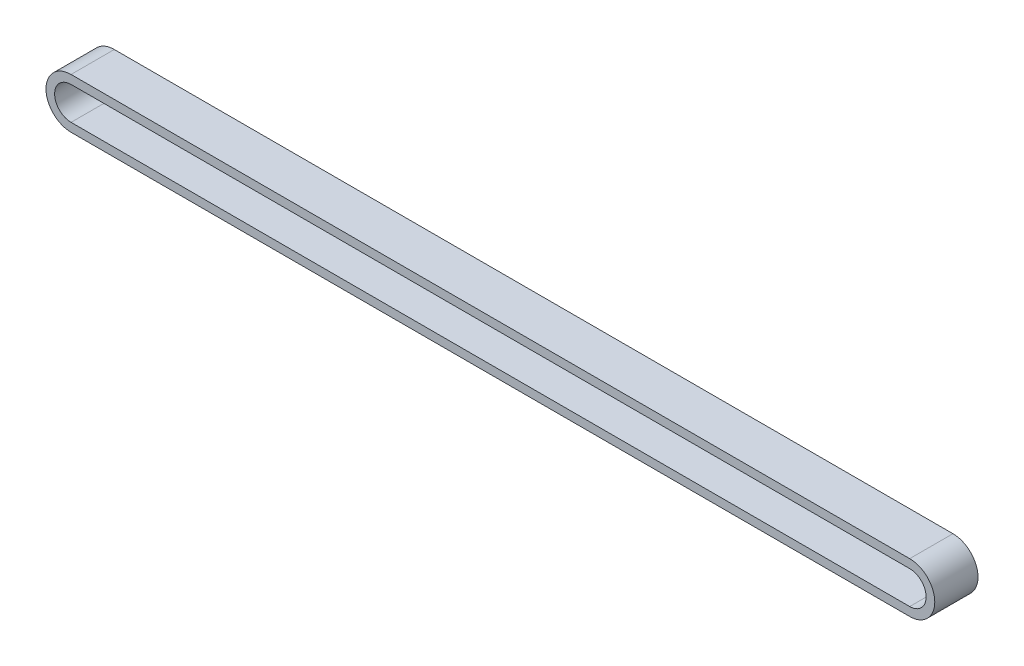
ISO-10303-21;
HEADER;
FILE_DESCRIPTION(('STEP AP214'),'2;1');
FILE_NAME('part.step','',(''),(''),'','','');
FILE_SCHEMA(('AUTOMOTIVE_DESIGN { 1 0 10303 214 1 1 1 1 }'));
ENDSEC;
DATA;
#1=APPLICATION_CONTEXT('core data for automotive mechanical design processes');
#2=APPLICATION_PROTOCOL_DEFINITION('international standard','automotive_design',2000,#1);
#3=PRODUCT_CONTEXT('',#1,'mechanical');
#4=PRODUCT('Part','Part','',(#3));
#5=PRODUCT_RELATED_PRODUCT_CATEGORY('part','',(#4));
#6=PRODUCT_DEFINITION_FORMATION('','',#4);
#7=PRODUCT_DEFINITION_CONTEXT('part definition',#1,'design');
#8=PRODUCT_DEFINITION('design','',#6,#7);
#9=PRODUCT_DEFINITION_SHAPE('','',#8);
#10=(LENGTH_UNIT() NAMED_UNIT(*) SI_UNIT(.MILLI.,.METRE.));
#11=(NAMED_UNIT(*) PLANE_ANGLE_UNIT() SI_UNIT($,.RADIAN.));
#12=(NAMED_UNIT(*) SI_UNIT($,.STERADIAN.) SOLID_ANGLE_UNIT());
#13=UNCERTAINTY_MEASURE_WITH_UNIT(LENGTH_MEASURE(1.E-05),#10,'distance_accuracy_value','');
#14=(GEOMETRIC_REPRESENTATION_CONTEXT(3) GLOBAL_UNCERTAINTY_ASSIGNED_CONTEXT((#13)) GLOBAL_UNIT_ASSIGNED_CONTEXT((#10,
#11,#12)) REPRESENTATION_CONTEXT('',''));
#15=CARTESIAN_POINT('',(0.,0.,0.));
#16=DIRECTION('',(0.,0.,1.));
#17=DIRECTION('',(1.,0.,0.));
#18=AXIS2_PLACEMENT_3D('',#15,#16,#17);
#19=CARTESIAN_POINT('',(-204.016557458946,-10.0165574589457,10.));
#20=DIRECTION('',(0.,0.,1.));
#21=DIRECTION('',(1.,0.,0.));
#22=AXIS2_PLACEMENT_3D('',#19,#20,#21);
#23=PLANE('',#22);
#24=CARTESIAN_POINT('',(-204.016557458946,-10.0165574589457,10.));
#25=DIRECTION('',(0.,0.,1.));
#26=DIRECTION('',(1.,0.,0.));
#27=AXIS2_PLACEMENT_3D('',#24,#25,#26);
#28=CIRCLE('',#27,5.79708670005154);
#29=CARTESIAN_POINT('',(-204.016557458946,-4.21947075889413,10.));
#30=VERTEX_POINT('',#29);
#31=CARTESIAN_POINT('',(-204.016557458946,-15.8136441589972,10.));
#32=VERTEX_POINT('',#31);
#33=EDGE_CURVE('E133',#30,#32,#28,.T.);
#34=ORIENTED_EDGE('',*,*,#33,.T.);
#35=DIRECTION('',(1.,0.,0.));
#36=VECTOR('',#35,1.);
#37=CARTESIAN_POINT('',(-10.0165574589457,-15.8136441589972,10.));
#38=LINE('',#37,#36);
#39=CARTESIAN_POINT('',(-10.0165574589457,-15.8136441589972,10.));
#40=VERTEX_POINT('',#39);
#41=EDGE_CURVE('E136',#32,#40,#38,.T.);
#42=ORIENTED_EDGE('',*,*,#41,.T.);
#43=CARTESIAN_POINT('',(-10.0165574589457,-10.0165574589457,10.));
#44=DIRECTION('',(0.,0.,1.));
#45=DIRECTION('',(1.,0.,0.));
#46=AXIS2_PLACEMENT_3D('',#43,#44,#45);
#47=CIRCLE('',#46,5.79708670005154);
#48=CARTESIAN_POINT('',(-10.0165574589457,-4.21947075889413,10.));
#49=VERTEX_POINT('',#48);
#50=EDGE_CURVE('E139',#40,#49,#47,.T.);
#51=ORIENTED_EDGE('',*,*,#50,.T.);
#52=DIRECTION('',(-1.,0.,0.));
#53=VECTOR('',#52,1.);
#54=CARTESIAN_POINT('',(-204.016557458946,-4.21947075889413,10.));
#55=LINE('',#54,#53);
#56=EDGE_CURVE('E141',#49,#30,#55,.T.);
#57=ORIENTED_EDGE('',*,*,#56,.T.);
#58=EDGE_LOOP('',(#34,#42,#51,#57));
#59=FACE_BOUND('',#58,.T.);
#60=DIRECTION('',(1.,0.,0.));
#61=VECTOR('',#60,1.);
#62=CARTESIAN_POINT('',(-10.0165574589457,-13.8136441589972,10.));
#63=LINE('',#62,#61);
#64=CARTESIAN_POINT('',(-204.016557458946,-13.8136441589972,10.));
#65=VERTEX_POINT('',#64);
#66=CARTESIAN_POINT('',(-10.0165574589457,-13.8136441589972,10.));
#67=VERTEX_POINT('',#66);
#68=EDGE_CURVE('E105',#65,#67,#63,.T.);
#69=ORIENTED_EDGE('',*,*,#68,.F.);
#70=CARTESIAN_POINT('',(-204.016557458946,-10.0165574589457,10.));
#71=DIRECTION('',(0.,0.,1.));
#72=DIRECTION('',(1.,0.,0.));
#73=AXIS2_PLACEMENT_3D('',#70,#71,#72);
#74=CIRCLE('',#73,3.79708670005154);
#75=CARTESIAN_POINT('',(-204.016557458946,-6.21947075889413,10.));
#76=VERTEX_POINT('',#75);
#77=EDGE_CURVE('E97',#76,#65,#74,.T.);
#78=ORIENTED_EDGE('',*,*,#77,.F.);
#79=DIRECTION('',(-1.,0.,0.));
#80=VECTOR('',#79,1.);
#81=CARTESIAN_POINT('',(-204.016557458946,-6.21947075889413,10.));
#82=LINE('',#81,#80);
#83=CARTESIAN_POINT('',(-10.0165574589457,-6.21947075889412,10.));
#84=VERTEX_POINT('',#83);
#85=EDGE_CURVE('E119',#84,#76,#82,.T.);
#86=ORIENTED_EDGE('',*,*,#85,.F.);
#87=CARTESIAN_POINT('',(-10.0165574589457,-10.0165574589457,10.));
#88=DIRECTION('',(0.,0.,1.));
#89=DIRECTION('',(1.,0.,0.));
#90=AXIS2_PLACEMENT_3D('',#87,#88,#89);
#91=CIRCLE('',#90,3.79708670005155);
#92=EDGE_CURVE('E117',#67,#84,#91,.T.);
#93=ORIENTED_EDGE('',*,*,#92,.F.);
#94=EDGE_LOOP('',(#69,#78,#86,#93));
#95=FACE_BOUND('',#94,.T.);
#96=ADVANCED_FACE('F32',(#59,#95),#23,.T.);
#97=CARTESIAN_POINT('',(-204.016557458946,-10.0165574589457,0.));
#98=DIRECTION('',(0.,0.,1.));
#99=DIRECTION('',(1.,0.,0.));
#100=AXIS2_PLACEMENT_3D('',#97,#98,#99);
#101=PLANE('',#100);
#102=CARTESIAN_POINT('',(-204.016557458946,-10.0165574589457,0.));
#103=DIRECTION('',(0.,0.,1.));
#104=DIRECTION('',(1.,0.,0.));
#105=AXIS2_PLACEMENT_3D('',#102,#103,#104);
#106=CIRCLE('',#105,5.79708670005154);
#107=CARTESIAN_POINT('',(-204.016557458946,-4.21947075889413,0.));
#108=VERTEX_POINT('',#107);
#109=CARTESIAN_POINT('',(-204.016557458946,-15.8136441589972,0.));
#110=VERTEX_POINT('',#109);
#111=EDGE_CURVE('E113',#108,#110,#106,.T.);
#112=ORIENTED_EDGE('',*,*,#111,.F.);
#113=DIRECTION('',(-1.,0.,0.));
#114=VECTOR('',#113,1.);
#115=CARTESIAN_POINT('',(-204.016557458946,-4.21947075889413,0.));
#116=LINE('',#115,#114);
#117=CARTESIAN_POINT('',(-10.0165574589457,-4.21947075889413,0.));
#118=VERTEX_POINT('',#117);
#119=EDGE_CURVE('E137',#118,#108,#116,.T.);
#120=ORIENTED_EDGE('',*,*,#119,.F.);
#121=CARTESIAN_POINT('',(-10.0165574589457,-10.0165574589457,0.));
#122=DIRECTION('',(0.,0.,1.));
#123=DIRECTION('',(1.,0.,0.));
#124=AXIS2_PLACEMENT_3D('',#121,#122,#123);
#125=CIRCLE('',#124,5.79708670005154);
#126=CARTESIAN_POINT('',(-10.0165574589457,-15.8136441589972,0.));
#127=VERTEX_POINT('',#126);
#128=EDGE_CURVE('E148',#127,#118,#125,.T.);
#129=ORIENTED_EDGE('',*,*,#128,.F.);
#130=DIRECTION('',(1.,0.,0.));
#131=VECTOR('',#130,1.);
#132=CARTESIAN_POINT('',(-10.0165574589457,-15.8136441589972,0.));
#133=LINE('',#132,#131);
#134=EDGE_CURVE('E146',#110,#127,#133,.T.);
#135=ORIENTED_EDGE('',*,*,#134,.F.);
#136=EDGE_LOOP('',(#112,#120,#129,#135));
#137=FACE_BOUND('',#136,.T.);
#138=CARTESIAN_POINT('',(-204.016557458946,-10.0165574589457,0.));
#139=DIRECTION('',(0.,0.,1.));
#140=DIRECTION('',(1.,0.,0.));
#141=AXIS2_PLACEMENT_3D('',#138,#139,#140);
#142=CIRCLE('',#141,3.79708670005154);
#143=CARTESIAN_POINT('',(-204.016557458946,-6.21947075889413,0.));
#144=VERTEX_POINT('',#143);
#145=CARTESIAN_POINT('',(-204.016557458946,-13.8136441589972,0.));
#146=VERTEX_POINT('',#145);
#147=EDGE_CURVE('E55',#144,#146,#142,.T.);
#148=ORIENTED_EDGE('',*,*,#147,.T.);
#149=DIRECTION('',(1.,0.,0.));
#150=VECTOR('',#149,1.);
#151=CARTESIAN_POINT('',(-10.0165574589457,-13.8136441589972,0.));
#152=LINE('',#151,#150);
#153=CARTESIAN_POINT('',(-10.0165574589457,-13.8136441589972,0.));
#154=VERTEX_POINT('',#153);
#155=EDGE_CURVE('E112',#146,#154,#152,.T.);
#156=ORIENTED_EDGE('',*,*,#155,.T.);
#157=CARTESIAN_POINT('',(-10.0165574589457,-10.0165574589457,0.));
#158=DIRECTION('',(0.,0.,1.));
#159=DIRECTION('',(1.,0.,0.));
#160=AXIS2_PLACEMENT_3D('',#157,#158,#159);
#161=CIRCLE('',#160,3.79708670005155);
#162=CARTESIAN_POINT('',(-10.0165574589457,-6.21947075889412,0.));
#163=VERTEX_POINT('',#162);
#164=EDGE_CURVE('E125',#154,#163,#161,.T.);
#165=ORIENTED_EDGE('',*,*,#164,.T.);
#166=DIRECTION('',(-1.,0.,0.));
#167=VECTOR('',#166,1.);
#168=CARTESIAN_POINT('',(-204.016557458946,-6.21947075889413,0.));
#169=LINE('',#168,#167);
#170=EDGE_CURVE('E106',#163,#144,#169,.T.);
#171=ORIENTED_EDGE('',*,*,#170,.T.);
#172=EDGE_LOOP('',(#148,#156,#165,#171));
#173=FACE_BOUND('',#172,.T.);
#174=ADVANCED_FACE('F166',(#137,#173),#101,.F.);
#175=CARTESIAN_POINT('',(-204.016557458946,-10.0165574589457,10.));
#176=DIRECTION('',(0.,0.,-1.));
#177=DIRECTION('',(-1.,0.,0.));
#178=AXIS2_PLACEMENT_3D('',#175,#176,#177);
#179=CYLINDRICAL_SURFACE('',#178,5.79708670005154);
#180=ORIENTED_EDGE('',*,*,#111,.T.);
#181=DIRECTION('',(0.,0.,-1.));
#182=VECTOR('',#181,1.);
#183=CARTESIAN_POINT('',(-204.016557458946,-15.8136441589972,10.));
#184=LINE('',#183,#182);
#185=EDGE_CURVE('E11',#32,#110,#184,.T.);
#186=ORIENTED_EDGE('',*,*,#185,.F.);
#187=ORIENTED_EDGE('',*,*,#33,.F.);
#188=DIRECTION('',(0.,0.,-1.));
#189=VECTOR('',#188,1.);
#190=CARTESIAN_POINT('',(-204.016557458946,-4.21947075889413,10.));
#191=LINE('',#190,#189);
#192=EDGE_CURVE('E143',#30,#108,#191,.T.);
#193=ORIENTED_EDGE('',*,*,#192,.T.);
#194=EDGE_LOOP('',(#180,#186,#187,#193));
#195=FACE_BOUND('',#194,.T.);
#196=ADVANCED_FACE('F34',(#195),#179,.T.);
#197=CARTESIAN_POINT('',(-10.0165574589457,-15.8136441589972,10.));
#198=DIRECTION('',(0.,1.,0.));
#199=DIRECTION('',(0.,0.,1.));
#200=AXIS2_PLACEMENT_3D('',#197,#198,#199);
#201=PLANE('',#200);
#202=ORIENTED_EDGE('',*,*,#134,.T.);
#203=DIRECTION('',(0.,0.,-1.));
#204=VECTOR('',#203,1.);
#205=CARTESIAN_POINT('',(-10.0165574589457,-15.8136441589972,10.));
#206=LINE('',#205,#204);
#207=EDGE_CURVE('E40',#40,#127,#206,.T.);
#208=ORIENTED_EDGE('',*,*,#207,.F.);
#209=ORIENTED_EDGE('',*,*,#41,.F.);
#210=ORIENTED_EDGE('',*,*,#185,.T.);
#211=EDGE_LOOP('',(#202,#208,#209,#210));
#212=FACE_BOUND('',#211,.T.);
#213=ADVANCED_FACE('F176',(#212),#201,.F.);
#214=CARTESIAN_POINT('',(-10.0165574589457,-10.0165574589457,10.));
#215=DIRECTION('',(0.,0.,-1.));
#216=DIRECTION('',(-1.,0.,0.));
#217=AXIS2_PLACEMENT_3D('',#214,#215,#216);
#218=CYLINDRICAL_SURFACE('',#217,5.79708670005154);
#219=ORIENTED_EDGE('',*,*,#128,.T.);
#220=DIRECTION('',(0.,0.,-1.));
#221=VECTOR('',#220,1.);
#222=CARTESIAN_POINT('',(-10.0165574589457,-4.21947075889413,10.));
#223=LINE('',#222,#221);
#224=EDGE_CURVE('E153',#49,#118,#223,.T.);
#225=ORIENTED_EDGE('',*,*,#224,.F.);
#226=ORIENTED_EDGE('',*,*,#50,.F.);
#227=ORIENTED_EDGE('',*,*,#207,.T.);
#228=EDGE_LOOP('',(#219,#225,#226,#227));
#229=FACE_BOUND('',#228,.T.);
#230=ADVANCED_FACE('F160',(#229),#218,.T.);
#231=CARTESIAN_POINT('',(-204.016557458946,-4.21947075889413,10.));
#232=DIRECTION('',(0.,-1.,0.));
#233=DIRECTION('',(0.,0.,-1.));
#234=AXIS2_PLACEMENT_3D('',#231,#232,#233);
#235=PLANE('',#234);
#236=ORIENTED_EDGE('',*,*,#119,.T.);
#237=ORIENTED_EDGE('',*,*,#192,.F.);
#238=ORIENTED_EDGE('',*,*,#56,.F.);
#239=ORIENTED_EDGE('',*,*,#224,.T.);
#240=EDGE_LOOP('',(#236,#237,#238,#239));
#241=FACE_BOUND('',#240,.T.);
#242=ADVANCED_FACE('F170',(#241),#235,.F.);
#243=CARTESIAN_POINT('',(-204.016557458946,-10.0165574589457,10.));
#244=DIRECTION('',(0.,0.,-1.));
#245=DIRECTION('',(-1.,0.,0.));
#246=AXIS2_PLACEMENT_3D('',#243,#244,#245);
#247=CYLINDRICAL_SURFACE('',#246,3.79708670005154);
#248=ORIENTED_EDGE('',*,*,#147,.F.);
#249=DIRECTION('',(0.,0.,-1.));
#250=VECTOR('',#249,1.);
#251=CARTESIAN_POINT('',(-204.016557458946,-6.21947075889413,10.));
#252=LINE('',#251,#250);
#253=EDGE_CURVE('E101',#76,#144,#252,.T.);
#254=ORIENTED_EDGE('',*,*,#253,.F.);
#255=ORIENTED_EDGE('',*,*,#77,.T.);
#256=DIRECTION('',(0.,0.,-1.));
#257=VECTOR('',#256,1.);
#258=CARTESIAN_POINT('',(-204.016557458946,-13.8136441589972,10.));
#259=LINE('',#258,#257);
#260=EDGE_CURVE('E100',#65,#146,#259,.T.);
#261=ORIENTED_EDGE('',*,*,#260,.T.);
#262=EDGE_LOOP('',(#248,#254,#255,#261));
#263=FACE_BOUND('',#262,.T.);
#264=ADVANCED_FACE('F99',(#263),#247,.F.);
#265=CARTESIAN_POINT('',(-10.0165574589457,-13.8136441589972,10.));
#266=DIRECTION('',(0.,1.,0.));
#267=DIRECTION('',(-1.,0.,0.));
#268=AXIS2_PLACEMENT_3D('',#265,#266,#267);
#269=PLANE('',#268);
#270=ORIENTED_EDGE('',*,*,#155,.F.);
#271=ORIENTED_EDGE('',*,*,#260,.F.);
#272=ORIENTED_EDGE('',*,*,#68,.T.);
#273=DIRECTION('',(0.,0.,-1.));
#274=VECTOR('',#273,1.);
#275=CARTESIAN_POINT('',(-10.0165574589457,-13.8136441589972,10.));
#276=LINE('',#275,#274);
#277=EDGE_CURVE('E114',#67,#154,#276,.T.);
#278=ORIENTED_EDGE('',*,*,#277,.T.);
#279=EDGE_LOOP('',(#270,#271,#272,#278));
#280=FACE_BOUND('',#279,.T.);
#281=ADVANCED_FACE('F109',(#280),#269,.T.);
#282=CARTESIAN_POINT('',(-10.0165574589457,-10.0165574589457,10.));
#283=DIRECTION('',(0.,0.,-1.));
#284=DIRECTION('',(-1.,0.,0.));
#285=AXIS2_PLACEMENT_3D('',#282,#283,#284);
#286=CYLINDRICAL_SURFACE('',#285,3.79708670005155);
#287=ORIENTED_EDGE('',*,*,#164,.F.);
#288=ORIENTED_EDGE('',*,*,#277,.F.);
#289=ORIENTED_EDGE('',*,*,#92,.T.);
#290=DIRECTION('',(0.,0.,-1.));
#291=VECTOR('',#290,1.);
#292=CARTESIAN_POINT('',(-10.0165574589457,-6.21947075889412,10.));
#293=LINE('',#292,#291);
#294=EDGE_CURVE('E47',#84,#163,#293,.T.);
#295=ORIENTED_EDGE('',*,*,#294,.T.);
#296=EDGE_LOOP('',(#287,#288,#289,#295));
#297=FACE_BOUND('',#296,.T.);
#298=ADVANCED_FACE('F199',(#297),#286,.F.);
#299=CARTESIAN_POINT('',(-204.016557458946,-6.21947075889413,10.));
#300=DIRECTION('',(0.,-1.,0.));
#301=DIRECTION('',(1.,0.,0.));
#302=AXIS2_PLACEMENT_3D('',#299,#300,#301);
#303=PLANE('',#302);
#304=ORIENTED_EDGE('',*,*,#170,.F.);
#305=ORIENTED_EDGE('',*,*,#294,.F.);
#306=ORIENTED_EDGE('',*,*,#85,.T.);
#307=ORIENTED_EDGE('',*,*,#253,.T.);
#308=EDGE_LOOP('',(#304,#305,#306,#307));
#309=FACE_BOUND('',#308,.T.);
#310=ADVANCED_FACE('F203',(#309),#303,.T.);
#311=CLOSED_SHELL('',(#96,#174,#196,#213,#230,#242,#264,#281,#298,#310));
#312=MANIFOLD_SOLID_BREP('B2',#311);
#313=ADVANCED_BREP_SHAPE_REPRESENTATION('',(#18,#312),#14);
#314=SHAPE_DEFINITION_REPRESENTATION(#9,#313);
ENDSEC;
END-ISO-10303-21;
